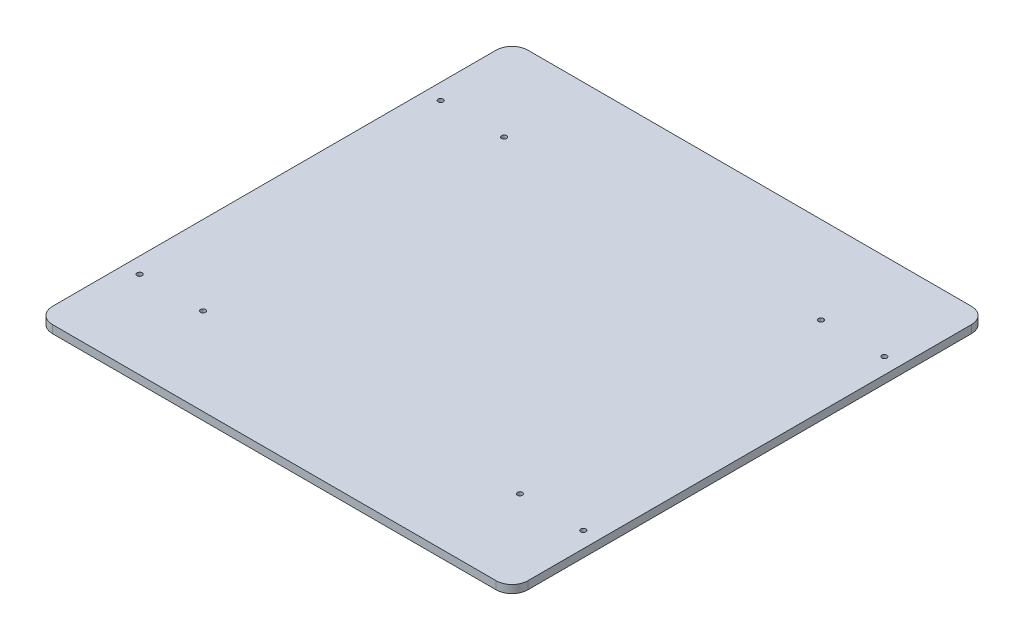
ISO-10303-21;
HEADER;
FILE_DESCRIPTION(('STEP AP214'),'2;1');
FILE_NAME('part.step','',(''),(''),'','','');
FILE_SCHEMA(('AUTOMOTIVE_DESIGN { 1 0 10303 214 1 1 1 1 }'));
ENDSEC;
DATA;
#1=APPLICATION_CONTEXT('core data for automotive mechanical design processes');
#2=APPLICATION_PROTOCOL_DEFINITION('international standard','automotive_design',2000,#1);
#3=PRODUCT_CONTEXT('',#1,'mechanical');
#4=PRODUCT('Part','Part','',(#3));
#5=PRODUCT_RELATED_PRODUCT_CATEGORY('part','',(#4));
#6=PRODUCT_DEFINITION_FORMATION('','',#4);
#7=PRODUCT_DEFINITION_CONTEXT('part definition',#1,'design');
#8=PRODUCT_DEFINITION('design','',#6,#7);
#9=PRODUCT_DEFINITION_SHAPE('','',#8);
#10=(LENGTH_UNIT() NAMED_UNIT(*) SI_UNIT(.MILLI.,.METRE.));
#11=(NAMED_UNIT(*) PLANE_ANGLE_UNIT() SI_UNIT($,.RADIAN.));
#12=(NAMED_UNIT(*) SI_UNIT($,.STERADIAN.) SOLID_ANGLE_UNIT());
#13=UNCERTAINTY_MEASURE_WITH_UNIT(LENGTH_MEASURE(1.E-05),#10,'distance_accuracy_value','');
#14=(GEOMETRIC_REPRESENTATION_CONTEXT(3) GLOBAL_UNCERTAINTY_ASSIGNED_CONTEXT((#13)) GLOBAL_UNIT_ASSIGNED_CONTEXT((#10,
#11,#12)) REPRESENTATION_CONTEXT('',''));
#15=CARTESIAN_POINT('',(0.,0.,0.));
#16=DIRECTION('',(0.,0.,1.));
#17=DIRECTION('',(1.,0.,0.));
#18=AXIS2_PLACEMENT_3D('',#15,#16,#17);
#19=CARTESIAN_POINT('',(140.,5.,-95.));
#20=DIRECTION('',(0.,-1.,0.));
#21=DIRECTION('',(0.,0.,-1.));
#22=AXIS2_PLACEMENT_3D('',#19,#20,#21);
#23=CYLINDRICAL_SURFACE('',#22,1.59999999999999);
#24=CARTESIAN_POINT('',(140.,5.,-95.));
#25=DIRECTION('',(0.,-1.,0.));
#26=DIRECTION('',(0.,0.,-1.));
#27=AXIS2_PLACEMENT_3D('',#24,#25,#26);
#28=CIRCLE('',#27,1.59999999999999);
#29=CARTESIAN_POINT('',(140.,5.,-96.6));
#30=VERTEX_POINT('',#29);
#31=EDGE_CURVE('E52',#30,#30,#28,.T.);
#32=ORIENTED_EDGE('',*,*,#31,.F.);
#33=EDGE_LOOP('',(#32));
#34=FACE_BOUND('',#33,.T.);
#35=CARTESIAN_POINT('',(140.,0.,-95.));
#36=DIRECTION('',(0.,-1.,0.));
#37=DIRECTION('',(0.,0.,-1.));
#38=AXIS2_PLACEMENT_3D('',#35,#36,#37);
#39=CIRCLE('',#38,1.59999999999999);
#40=CARTESIAN_POINT('',(140.,0.,-96.6));
#41=VERTEX_POINT('',#40);
#42=EDGE_CURVE('E11',#41,#41,#39,.T.);
#43=ORIENTED_EDGE('',*,*,#42,.T.);
#44=EDGE_LOOP('',(#43));
#45=FACE_BOUND('',#44,.T.);
#46=ADVANCED_FACE('F44',(#34,#45),#23,.F.);
#47=CARTESIAN_POINT('',(-100.,5.,-95.));
#48=DIRECTION('',(0.,-1.,0.));
#49=DIRECTION('',(0.,0.,-1.));
#50=AXIS2_PLACEMENT_3D('',#47,#48,#49);
#51=CYLINDRICAL_SURFACE('',#50,1.59999999999999);
#52=CARTESIAN_POINT('',(-100.,5.,-95.));
#53=DIRECTION('',(0.,-1.,0.));
#54=DIRECTION('',(0.,0.,-1.));
#55=AXIS2_PLACEMENT_3D('',#52,#53,#54);
#56=CIRCLE('',#55,1.59999999999999);
#57=CARTESIAN_POINT('',(-100.,5.,-96.6));
#58=VERTEX_POINT('',#57);
#59=EDGE_CURVE('E206',#58,#58,#56,.T.);
#60=ORIENTED_EDGE('',*,*,#59,.F.);
#61=EDGE_LOOP('',(#60));
#62=FACE_BOUND('',#61,.T.);
#63=CARTESIAN_POINT('',(-100.,0.,-95.));
#64=DIRECTION('',(0.,-1.,0.));
#65=DIRECTION('',(0.,0.,-1.));
#66=AXIS2_PLACEMENT_3D('',#63,#64,#65);
#67=CIRCLE('',#66,1.59999999999999);
#68=CARTESIAN_POINT('',(-100.,0.,-96.6));
#69=VERTEX_POINT('',#68);
#70=EDGE_CURVE('E210',#69,#69,#67,.T.);
#71=ORIENTED_EDGE('',*,*,#70,.T.);
#72=EDGE_LOOP('',(#71));
#73=FACE_BOUND('',#72,.T.);
#74=ADVANCED_FACE('F221',(#62,#73),#51,.F.);
#75=CARTESIAN_POINT('',(100.,5.,-95.));
#76=DIRECTION('',(0.,-1.,0.));
#77=DIRECTION('',(0.,0.,-1.));
#78=AXIS2_PLACEMENT_3D('',#75,#76,#77);
#79=CYLINDRICAL_SURFACE('',#78,1.59999999999999);
#80=CARTESIAN_POINT('',(100.,5.,-95.));
#81=DIRECTION('',(0.,-1.,0.));
#82=DIRECTION('',(0.,0.,-1.));
#83=AXIS2_PLACEMENT_3D('',#80,#81,#82);
#84=CIRCLE('',#83,1.59999999999999);
#85=CARTESIAN_POINT('',(100.,5.,-96.6));
#86=VERTEX_POINT('',#85);
#87=EDGE_CURVE('E198',#86,#86,#84,.T.);
#88=ORIENTED_EDGE('',*,*,#87,.F.);
#89=EDGE_LOOP('',(#88));
#90=FACE_BOUND('',#89,.T.);
#91=CARTESIAN_POINT('',(100.,0.,-95.));
#92=DIRECTION('',(0.,-1.,0.));
#93=DIRECTION('',(0.,0.,-1.));
#94=AXIS2_PLACEMENT_3D('',#91,#92,#93);
#95=CIRCLE('',#94,1.59999999999999);
#96=CARTESIAN_POINT('',(100.,0.,-96.6));
#97=VERTEX_POINT('',#96);
#98=EDGE_CURVE('E202',#97,#97,#95,.T.);
#99=ORIENTED_EDGE('',*,*,#98,.T.);
#100=EDGE_LOOP('',(#99));
#101=FACE_BOUND('',#100,.T.);
#102=ADVANCED_FACE('F268',(#90,#101),#79,.F.);
#103=CARTESIAN_POINT('',(-140.,5.,-95.));
#104=DIRECTION('',(0.,-1.,0.));
#105=DIRECTION('',(0.,0.,-1.));
#106=AXIS2_PLACEMENT_3D('',#103,#104,#105);
#107=CYLINDRICAL_SURFACE('',#106,1.59999999999999);
#108=CARTESIAN_POINT('',(-140.,5.,-95.));
#109=DIRECTION('',(0.,-1.,0.));
#110=DIRECTION('',(0.,0.,-1.));
#111=AXIS2_PLACEMENT_3D('',#108,#109,#110);
#112=CIRCLE('',#111,1.59999999999999);
#113=CARTESIAN_POINT('',(-140.,5.,-96.6));
#114=VERTEX_POINT('',#113);
#115=EDGE_CURVE('E190',#114,#114,#112,.T.);
#116=ORIENTED_EDGE('',*,*,#115,.F.);
#117=EDGE_LOOP('',(#116));
#118=FACE_BOUND('',#117,.T.);
#119=CARTESIAN_POINT('',(-140.,0.,-95.));
#120=DIRECTION('',(0.,-1.,0.));
#121=DIRECTION('',(0.,0.,-1.));
#122=AXIS2_PLACEMENT_3D('',#119,#120,#121);
#123=CIRCLE('',#122,1.59999999999999);
#124=CARTESIAN_POINT('',(-140.,0.,-96.6));
#125=VERTEX_POINT('',#124);
#126=EDGE_CURVE('E194',#125,#125,#123,.T.);
#127=ORIENTED_EDGE('',*,*,#126,.T.);
#128=EDGE_LOOP('',(#127));
#129=FACE_BOUND('',#128,.T.);
#130=ADVANCED_FACE('F251',(#118,#129),#107,.F.);
#131=CARTESIAN_POINT('',(150.,5.,150.));
#132=DIRECTION('',(-1.,0.,0.));
#133=DIRECTION('',(0.,0.,1.));
#134=AXIS2_PLACEMENT_3D('',#131,#132,#133);
#135=PLANE('',#134);
#136=DIRECTION('',(0.,0.,-1.));
#137=VECTOR('',#136,1.);
#138=CARTESIAN_POINT('',(150.,0.,150.));
#139=LINE('',#138,#137);
#140=CARTESIAN_POINT('',(150.,0.,140.));
#141=VERTEX_POINT('',#140);
#142=CARTESIAN_POINT('',(150.,0.,-140.));
#143=VERTEX_POINT('',#142);
#144=EDGE_CURVE('E147',#141,#143,#139,.T.);
#145=ORIENTED_EDGE('',*,*,#144,.T.);
#146=DIRECTION('',(0.,-1.,0.));
#147=VECTOR('',#146,1.);
#148=CARTESIAN_POINT('',(150.,5.,-140.));
#149=LINE('',#148,#147);
#150=CARTESIAN_POINT('',(150.,5.,-140.));
#151=VERTEX_POINT('',#150);
#152=EDGE_CURVE('E181',#143,#151,#149,.F.);
#153=ORIENTED_EDGE('',*,*,#152,.T.);
#154=DIRECTION('',(0.,0.,-1.));
#155=VECTOR('',#154,1.);
#156=CARTESIAN_POINT('',(150.,5.,150.));
#157=LINE('',#156,#155);
#158=CARTESIAN_POINT('',(150.,5.,140.));
#159=VERTEX_POINT('',#158);
#160=EDGE_CURVE('E145',#159,#151,#157,.T.);
#161=ORIENTED_EDGE('',*,*,#160,.F.);
#162=DIRECTION('',(0.,-1.,0.));
#163=VECTOR('',#162,1.);
#164=CARTESIAN_POINT('',(150.,5.,140.));
#165=LINE('',#164,#163);
#166=EDGE_CURVE('E177',#159,#141,#165,.T.);
#167=ORIENTED_EDGE('',*,*,#166,.T.);
#168=EDGE_LOOP('',(#145,#153,#161,#167));
#169=FACE_BOUND('',#168,.T.);
#170=ADVANCED_FACE('F248',(#169),#135,.F.);
#171=CARTESIAN_POINT('',(-150.,5.,-150.));
#172=DIRECTION('',(0.,0.,1.));
#173=DIRECTION('',(1.,0.,0.));
#174=AXIS2_PLACEMENT_3D('',#171,#172,#173);
#175=PLANE('',#174);
#176=DIRECTION('',(-1.,0.,0.));
#177=VECTOR('',#176,1.);
#178=CARTESIAN_POINT('',(-150.,0.,-150.));
#179=LINE('',#178,#177);
#180=CARTESIAN_POINT('',(140.,0.,-150.));
#181=VERTEX_POINT('',#180);
#182=CARTESIAN_POINT('',(-140.,0.,-150.));
#183=VERTEX_POINT('',#182);
#184=EDGE_CURVE('E141',#181,#183,#179,.T.);
#185=ORIENTED_EDGE('',*,*,#184,.T.);
#186=DIRECTION('',(0.,-1.,0.));
#187=VECTOR('',#186,1.);
#188=CARTESIAN_POINT('',(-140.,5.,-150.));
#189=LINE('',#188,#187);
#190=CARTESIAN_POINT('',(-140.,5.,-150.));
#191=VERTEX_POINT('',#190);
#192=EDGE_CURVE('E116',#183,#191,#189,.F.);
#193=ORIENTED_EDGE('',*,*,#192,.T.);
#194=DIRECTION('',(-1.,0.,0.));
#195=VECTOR('',#194,1.);
#196=CARTESIAN_POINT('',(-150.,5.,-150.));
#197=LINE('',#196,#195);
#198=CARTESIAN_POINT('',(140.,5.,-150.));
#199=VERTEX_POINT('',#198);
#200=EDGE_CURVE('E473',#199,#191,#197,.T.);
#201=ORIENTED_EDGE('',*,*,#200,.F.);
#202=DIRECTION('',(0.,-1.,0.));
#203=VECTOR('',#202,1.);
#204=CARTESIAN_POINT('',(140.,5.,-150.));
#205=LINE('',#204,#203);
#206=EDGE_CURVE('E122',#199,#181,#205,.T.);
#207=ORIENTED_EDGE('',*,*,#206,.T.);
#208=EDGE_LOOP('',(#185,#193,#201,#207));
#209=FACE_BOUND('',#208,.T.);
#210=ADVANCED_FACE('F245',(#209),#175,.F.);
#211=CARTESIAN_POINT('',(-150.,5.,150.));
#212=DIRECTION('',(1.,0.,0.));
#213=DIRECTION('',(0.,0.,-1.));
#214=AXIS2_PLACEMENT_3D('',#211,#212,#213);
#215=PLANE('',#214);
#216=DIRECTION('',(0.,0.,1.));
#217=VECTOR('',#216,1.);
#218=CARTESIAN_POINT('',(-150.,5.,150.));
#219=LINE('',#218,#217);
#220=CARTESIAN_POINT('',(-150.,5.,-140.));
#221=VERTEX_POINT('',#220);
#222=CARTESIAN_POINT('',(-150.,5.,140.));
#223=VERTEX_POINT('',#222);
#224=EDGE_CURVE('E131',#221,#223,#219,.T.);
#225=ORIENTED_EDGE('',*,*,#224,.F.);
#226=DIRECTION('',(0.,-1.,0.));
#227=VECTOR('',#226,1.);
#228=CARTESIAN_POINT('',(-150.,5.,-140.));
#229=LINE('',#228,#227);
#230=CARTESIAN_POINT('',(-150.,0.,-140.));
#231=VERTEX_POINT('',#230);
#232=EDGE_CURVE('E115',#221,#231,#229,.T.);
#233=ORIENTED_EDGE('',*,*,#232,.T.);
#234=DIRECTION('',(0.,0.,1.));
#235=VECTOR('',#234,1.);
#236=CARTESIAN_POINT('',(-150.,0.,150.));
#237=LINE('',#236,#235);
#238=CARTESIAN_POINT('',(-150.,0.,140.));
#239=VERTEX_POINT('',#238);
#240=EDGE_CURVE('E129',#231,#239,#237,.T.);
#241=ORIENTED_EDGE('',*,*,#240,.T.);
#242=DIRECTION('',(0.,-1.,0.));
#243=VECTOR('',#242,1.);
#244=CARTESIAN_POINT('',(-150.,5.,140.));
#245=LINE('',#244,#243);
#246=EDGE_CURVE('E134',#239,#223,#245,.F.);
#247=ORIENTED_EDGE('',*,*,#246,.T.);
#248=EDGE_LOOP('',(#225,#233,#241,#247));
#249=FACE_BOUND('',#248,.T.);
#250=ADVANCED_FACE('F128',(#249),#215,.F.);
#251=CARTESIAN_POINT('',(-150.,5.,150.));
#252=DIRECTION('',(0.,0.,-1.));
#253=DIRECTION('',(-1.,0.,0.));
#254=AXIS2_PLACEMENT_3D('',#251,#252,#253);
#255=PLANE('',#254);
#256=DIRECTION('',(1.,0.,0.));
#257=VECTOR('',#256,1.);
#258=CARTESIAN_POINT('',(-150.,0.,150.));
#259=LINE('',#258,#257);
#260=CARTESIAN_POINT('',(-140.,0.,150.));
#261=VERTEX_POINT('',#260);
#262=CARTESIAN_POINT('',(140.,0.,150.));
#263=VERTEX_POINT('',#262);
#264=EDGE_CURVE('E140',#261,#263,#259,.T.);
#265=ORIENTED_EDGE('',*,*,#264,.T.);
#266=DIRECTION('',(0.,-1.,0.));
#267=VECTOR('',#266,1.);
#268=CARTESIAN_POINT('',(140.,5.,150.));
#269=LINE('',#268,#267);
#270=CARTESIAN_POINT('',(140.,5.,150.));
#271=VERTEX_POINT('',#270);
#272=EDGE_CURVE('E59',#263,#271,#269,.F.);
#273=ORIENTED_EDGE('',*,*,#272,.T.);
#274=DIRECTION('',(1.,0.,0.));
#275=VECTOR('',#274,1.);
#276=CARTESIAN_POINT('',(-150.,5.,150.));
#277=LINE('',#276,#275);
#278=CARTESIAN_POINT('',(-140.,5.,150.));
#279=VERTEX_POINT('',#278);
#280=EDGE_CURVE('E152',#279,#271,#277,.T.);
#281=ORIENTED_EDGE('',*,*,#280,.F.);
#282=DIRECTION('',(0.,-1.,0.));
#283=VECTOR('',#282,1.);
#284=CARTESIAN_POINT('',(-140.,5.,150.));
#285=LINE('',#284,#283);
#286=EDGE_CURVE('E184',#279,#261,#285,.T.);
#287=ORIENTED_EDGE('',*,*,#286,.T.);
#288=EDGE_LOOP('',(#265,#273,#281,#287));
#289=FACE_BOUND('',#288,.T.);
#290=ADVANCED_FACE('F234',(#289),#255,.F.);
#291=CARTESIAN_POINT('',(0.,5.,0.));
#292=DIRECTION('',(0.,-1.,0.));
#293=DIRECTION('',(0.,0.,-1.));
#294=AXIS2_PLACEMENT_3D('',#291,#292,#293);
#295=PLANE('',#294);
#296=CARTESIAN_POINT('',(140.,5.,95.));
#297=DIRECTION('',(0.,-1.,0.));
#298=DIRECTION('',(0.,0.,-1.));
#299=AXIS2_PLACEMENT_3D('',#296,#297,#298);
#300=CIRCLE('',#299,1.59999999999999);
#301=CARTESIAN_POINT('',(140.,5.,93.4));
#302=VERTEX_POINT('',#301);
#303=EDGE_CURVE('E438',#302,#302,#300,.T.);
#304=ORIENTED_EDGE('',*,*,#303,.T.);
#305=EDGE_LOOP('',(#304));
#306=FACE_BOUND('',#305,.T.);
#307=CARTESIAN_POINT('',(100.,5.,95.));
#308=DIRECTION('',(0.,-1.,0.));
#309=DIRECTION('',(0.,0.,-1.));
#310=AXIS2_PLACEMENT_3D('',#307,#308,#309);
#311=CIRCLE('',#310,1.59999999999999);
#312=CARTESIAN_POINT('',(100.,5.,93.4));
#313=VERTEX_POINT('',#312);
#314=EDGE_CURVE('E442',#313,#313,#311,.T.);
#315=ORIENTED_EDGE('',*,*,#314,.T.);
#316=EDGE_LOOP('',(#315));
#317=FACE_BOUND('',#316,.T.);
#318=CARTESIAN_POINT('',(-140.,5.,95.));
#319=DIRECTION('',(0.,-1.,0.));
#320=DIRECTION('',(0.,0.,-1.));
#321=AXIS2_PLACEMENT_3D('',#318,#319,#320);
#322=CIRCLE('',#321,1.59999999999999);
#323=CARTESIAN_POINT('',(-140.,5.,93.4));
#324=VERTEX_POINT('',#323);
#325=EDGE_CURVE('E455',#324,#324,#322,.T.);
#326=ORIENTED_EDGE('',*,*,#325,.T.);
#327=EDGE_LOOP('',(#326));
#328=FACE_BOUND('',#327,.T.);
#329=CARTESIAN_POINT('',(-100.,5.,95.));
#330=DIRECTION('',(0.,-1.,0.));
#331=DIRECTION('',(0.,0.,-1.));
#332=AXIS2_PLACEMENT_3D('',#329,#330,#331);
#333=CIRCLE('',#332,1.59999999999999);
#334=CARTESIAN_POINT('',(-100.,5.,93.4));
#335=VERTEX_POINT('',#334);
#336=EDGE_CURVE('E454',#335,#335,#333,.T.);
#337=ORIENTED_EDGE('',*,*,#336,.T.);
#338=EDGE_LOOP('',(#337));
#339=FACE_BOUND('',#338,.T.);
#340=ORIENTED_EDGE('',*,*,#200,.T.);
#341=CARTESIAN_POINT('',(-140.,5.,-140.));
#342=DIRECTION('',(0.,-1.,0.));
#343=DIRECTION('',(0.,0.,-1.));
#344=AXIS2_PLACEMENT_3D('',#341,#342,#343);
#345=CIRCLE('',#344,10.);
#346=EDGE_CURVE('E174',#191,#221,#345,.F.);
#347=ORIENTED_EDGE('',*,*,#346,.T.);
#348=ORIENTED_EDGE('',*,*,#224,.T.);
#349=CARTESIAN_POINT('',(-140.,5.,140.));
#350=DIRECTION('',(0.,-1.,0.));
#351=DIRECTION('',(0.,0.,-1.));
#352=AXIS2_PLACEMENT_3D('',#349,#350,#351);
#353=CIRCLE('',#352,10.);
#354=EDGE_CURVE('E66',#223,#279,#353,.F.);
#355=ORIENTED_EDGE('',*,*,#354,.T.);
#356=ORIENTED_EDGE('',*,*,#280,.T.);
#357=CARTESIAN_POINT('',(140.,5.,140.));
#358=DIRECTION('',(0.,-1.,0.));
#359=DIRECTION('',(0.,0.,-1.));
#360=AXIS2_PLACEMENT_3D('',#357,#358,#359);
#361=CIRCLE('',#360,10.);
#362=EDGE_CURVE('E168',#271,#159,#361,.F.);
#363=ORIENTED_EDGE('',*,*,#362,.T.);
#364=ORIENTED_EDGE('',*,*,#160,.T.);
#365=CARTESIAN_POINT('',(140.,5.,-140.));
#366=DIRECTION('',(0.,-1.,0.));
#367=DIRECTION('',(0.,0.,-1.));
#368=AXIS2_PLACEMENT_3D('',#365,#366,#367);
#369=CIRCLE('',#368,10.);
#370=EDGE_CURVE('E171',#151,#199,#369,.F.);
#371=ORIENTED_EDGE('',*,*,#370,.T.);
#372=EDGE_LOOP('',(#340,#347,#348,#355,#356,#363,#364,#371));
#373=FACE_BOUND('',#372,.T.);
#374=ORIENTED_EDGE('',*,*,#115,.T.);
#375=EDGE_LOOP('',(#374));
#376=FACE_BOUND('',#375,.T.);
#377=ORIENTED_EDGE('',*,*,#87,.T.);
#378=EDGE_LOOP('',(#377));
#379=FACE_BOUND('',#378,.T.);
#380=ORIENTED_EDGE('',*,*,#59,.T.);
#381=EDGE_LOOP('',(#380));
#382=FACE_BOUND('',#381,.T.);
#383=ORIENTED_EDGE('',*,*,#31,.T.);
#384=EDGE_LOOP('',(#383));
#385=FACE_BOUND('',#384,.T.);
#386=ADVANCED_FACE('F217',(#306,#317,#328,#339,#373,#376,#379,#382,#385),#295,.F.);
#387=CARTESIAN_POINT('',(0.,0.,0.));
#388=DIRECTION('',(0.,-1.,0.));
#389=DIRECTION('',(0.,0.,-1.));
#390=AXIS2_PLACEMENT_3D('',#387,#388,#389);
#391=PLANE('',#390);
#392=CARTESIAN_POINT('',(140.,0.,95.));
#393=DIRECTION('',(0.,-1.,0.));
#394=DIRECTION('',(0.,0.,-1.));
#395=AXIS2_PLACEMENT_3D('',#392,#393,#394);
#396=CIRCLE('',#395,1.59999999999999);
#397=CARTESIAN_POINT('',(140.,0.,93.4));
#398=VERTEX_POINT('',#397);
#399=EDGE_CURVE('E440',#398,#398,#396,.T.);
#400=ORIENTED_EDGE('',*,*,#399,.F.);
#401=EDGE_LOOP('',(#400));
#402=FACE_BOUND('',#401,.T.);
#403=CARTESIAN_POINT('',(100.,0.,95.));
#404=DIRECTION('',(0.,-1.,0.));
#405=DIRECTION('',(0.,0.,-1.));
#406=AXIS2_PLACEMENT_3D('',#403,#404,#405);
#407=CIRCLE('',#406,1.59999999999999);
#408=CARTESIAN_POINT('',(100.,0.,93.4));
#409=VERTEX_POINT('',#408);
#410=EDGE_CURVE('E447',#409,#409,#407,.T.);
#411=ORIENTED_EDGE('',*,*,#410,.F.);
#412=EDGE_LOOP('',(#411));
#413=FACE_BOUND('',#412,.T.);
#414=CARTESIAN_POINT('',(-140.,0.,95.));
#415=DIRECTION('',(0.,-1.,0.));
#416=DIRECTION('',(0.,0.,-1.));
#417=AXIS2_PLACEMENT_3D('',#414,#415,#416);
#418=CIRCLE('',#417,1.59999999999999);
#419=CARTESIAN_POINT('',(-140.,0.,93.4));
#420=VERTEX_POINT('',#419);
#421=EDGE_CURVE('E459',#420,#420,#418,.T.);
#422=ORIENTED_EDGE('',*,*,#421,.F.);
#423=EDGE_LOOP('',(#422));
#424=FACE_BOUND('',#423,.T.);
#425=CARTESIAN_POINT('',(-100.,0.,95.));
#426=DIRECTION('',(0.,-1.,0.));
#427=DIRECTION('',(0.,0.,-1.));
#428=AXIS2_PLACEMENT_3D('',#425,#426,#427);
#429=CIRCLE('',#428,1.59999999999999);
#430=CARTESIAN_POINT('',(-100.,0.,93.4));
#431=VERTEX_POINT('',#430);
#432=EDGE_CURVE('E463',#431,#431,#429,.T.);
#433=ORIENTED_EDGE('',*,*,#432,.F.);
#434=EDGE_LOOP('',(#433));
#435=FACE_BOUND('',#434,.T.);
#436=ORIENTED_EDGE('',*,*,#240,.F.);
#437=CARTESIAN_POINT('',(-140.,0.,-140.));
#438=DIRECTION('',(0.,-1.,0.));
#439=DIRECTION('',(0.,0.,-1.));
#440=AXIS2_PLACEMENT_3D('',#437,#438,#439);
#441=CIRCLE('',#440,10.);
#442=EDGE_CURVE('E111',#231,#183,#441,.T.);
#443=ORIENTED_EDGE('',*,*,#442,.T.);
#444=ORIENTED_EDGE('',*,*,#184,.F.);
#445=CARTESIAN_POINT('',(140.,0.,-140.));
#446=DIRECTION('',(0.,-1.,0.));
#447=DIRECTION('',(0.,0.,-1.));
#448=AXIS2_PLACEMENT_3D('',#445,#446,#447);
#449=CIRCLE('',#448,10.);
#450=EDGE_CURVE('E123',#181,#143,#449,.T.);
#451=ORIENTED_EDGE('',*,*,#450,.T.);
#452=ORIENTED_EDGE('',*,*,#144,.F.);
#453=CARTESIAN_POINT('',(140.,0.,140.));
#454=DIRECTION('',(0.,-1.,0.));
#455=DIRECTION('',(0.,0.,-1.));
#456=AXIS2_PLACEMENT_3D('',#453,#454,#455);
#457=CIRCLE('',#456,10.);
#458=EDGE_CURVE('E156',#141,#263,#457,.T.);
#459=ORIENTED_EDGE('',*,*,#458,.T.);
#460=ORIENTED_EDGE('',*,*,#264,.F.);
#461=CARTESIAN_POINT('',(-140.,0.,140.));
#462=DIRECTION('',(0.,-1.,0.));
#463=DIRECTION('',(0.,0.,-1.));
#464=AXIS2_PLACEMENT_3D('',#461,#462,#463);
#465=CIRCLE('',#464,10.);
#466=EDGE_CURVE('E133',#261,#239,#465,.T.);
#467=ORIENTED_EDGE('',*,*,#466,.T.);
#468=EDGE_LOOP('',(#436,#443,#444,#451,#452,#459,#460,#467));
#469=FACE_BOUND('',#468,.T.);
#470=ORIENTED_EDGE('',*,*,#126,.F.);
#471=EDGE_LOOP('',(#470));
#472=FACE_BOUND('',#471,.T.);
#473=ORIENTED_EDGE('',*,*,#98,.F.);
#474=EDGE_LOOP('',(#473));
#475=FACE_BOUND('',#474,.T.);
#476=ORIENTED_EDGE('',*,*,#70,.F.);
#477=EDGE_LOOP('',(#476));
#478=FACE_BOUND('',#477,.T.);
#479=ORIENTED_EDGE('',*,*,#42,.F.);
#480=EDGE_LOOP('',(#479));
#481=FACE_BOUND('',#480,.T.);
#482=ADVANCED_FACE('F136',(#402,#413,#424,#435,#469,#472,#475,#478,#481),#391,.T.);
#483=CARTESIAN_POINT('',(-140.,5.,-140.));
#484=DIRECTION('',(0.,-1.,0.));
#485=DIRECTION('',(0.,0.,-1.));
#486=AXIS2_PLACEMENT_3D('',#483,#484,#485);
#487=CYLINDRICAL_SURFACE('',#486,10.);
#488=ORIENTED_EDGE('',*,*,#346,.F.);
#489=ORIENTED_EDGE('',*,*,#192,.F.);
#490=ORIENTED_EDGE('',*,*,#442,.F.);
#491=ORIENTED_EDGE('',*,*,#232,.F.);
#492=EDGE_LOOP('',(#488,#489,#490,#491));
#493=FACE_BOUND('',#492,.T.);
#494=ADVANCED_FACE('F114',(#493),#487,.T.);
#495=CARTESIAN_POINT('',(140.,5.,-140.));
#496=DIRECTION('',(0.,-1.,0.));
#497=DIRECTION('',(0.,0.,-1.));
#498=AXIS2_PLACEMENT_3D('',#495,#496,#497);
#499=CYLINDRICAL_SURFACE('',#498,10.);
#500=ORIENTED_EDGE('',*,*,#370,.F.);
#501=ORIENTED_EDGE('',*,*,#152,.F.);
#502=ORIENTED_EDGE('',*,*,#450,.F.);
#503=ORIENTED_EDGE('',*,*,#206,.F.);
#504=EDGE_LOOP('',(#500,#501,#502,#503));
#505=FACE_BOUND('',#504,.T.);
#506=ADVANCED_FACE('F232',(#505),#499,.T.);
#507=CARTESIAN_POINT('',(140.,5.,140.));
#508=DIRECTION('',(0.,-1.,0.));
#509=DIRECTION('',(0.,0.,-1.));
#510=AXIS2_PLACEMENT_3D('',#507,#508,#509);
#511=CYLINDRICAL_SURFACE('',#510,10.);
#512=ORIENTED_EDGE('',*,*,#362,.F.);
#513=ORIENTED_EDGE('',*,*,#272,.F.);
#514=ORIENTED_EDGE('',*,*,#458,.F.);
#515=ORIENTED_EDGE('',*,*,#166,.F.);
#516=EDGE_LOOP('',(#512,#513,#514,#515));
#517=FACE_BOUND('',#516,.T.);
#518=ADVANCED_FACE('F256',(#517),#511,.T.);
#519=CARTESIAN_POINT('',(-140.,5.,140.));
#520=DIRECTION('',(0.,-1.,0.));
#521=DIRECTION('',(0.,0.,-1.));
#522=AXIS2_PLACEMENT_3D('',#519,#520,#521);
#523=CYLINDRICAL_SURFACE('',#522,10.);
#524=ORIENTED_EDGE('',*,*,#354,.F.);
#525=ORIENTED_EDGE('',*,*,#246,.F.);
#526=ORIENTED_EDGE('',*,*,#466,.F.);
#527=ORIENTED_EDGE('',*,*,#286,.F.);
#528=EDGE_LOOP('',(#524,#525,#526,#527));
#529=FACE_BOUND('',#528,.T.);
#530=ADVANCED_FACE('F260',(#529),#523,.T.);
#531=CARTESIAN_POINT('',(-100.,5.,95.));
#532=DIRECTION('',(0.,-1.,0.));
#533=DIRECTION('',(0.,0.,-1.));
#534=AXIS2_PLACEMENT_3D('',#531,#532,#533);
#535=CYLINDRICAL_SURFACE('',#534,1.59999999999999);
#536=ORIENTED_EDGE('',*,*,#336,.F.);
#537=EDGE_LOOP('',(#536));
#538=FACE_BOUND('',#537,.T.);
#539=ORIENTED_EDGE('',*,*,#432,.T.);
#540=EDGE_LOOP('',(#539));
#541=FACE_BOUND('',#540,.T.);
#542=ADVANCED_FACE('F264',(#538,#541),#535,.F.);
#543=CARTESIAN_POINT('',(-140.,5.,95.));
#544=DIRECTION('',(0.,-1.,0.));
#545=DIRECTION('',(0.,0.,-1.));
#546=AXIS2_PLACEMENT_3D('',#543,#544,#545);
#547=CYLINDRICAL_SURFACE('',#546,1.59999999999999);
#548=ORIENTED_EDGE('',*,*,#325,.F.);
#549=EDGE_LOOP('',(#548));
#550=FACE_BOUND('',#549,.T.);
#551=ORIENTED_EDGE('',*,*,#421,.T.);
#552=EDGE_LOOP('',(#551));
#553=FACE_BOUND('',#552,.T.);
#554=ADVANCED_FACE('F297',(#550,#553),#547,.F.);
#555=CARTESIAN_POINT('',(100.,5.,95.));
#556=DIRECTION('',(0.,-1.,0.));
#557=DIRECTION('',(0.,0.,-1.));
#558=AXIS2_PLACEMENT_3D('',#555,#556,#557);
#559=CYLINDRICAL_SURFACE('',#558,1.59999999999999);
#560=ORIENTED_EDGE('',*,*,#314,.F.);
#561=EDGE_LOOP('',(#560));
#562=FACE_BOUND('',#561,.T.);
#563=ORIENTED_EDGE('',*,*,#410,.T.);
#564=EDGE_LOOP('',(#563));
#565=FACE_BOUND('',#564,.T.);
#566=ADVANCED_FACE('F305',(#562,#565),#559,.F.);
#567=CARTESIAN_POINT('',(140.,5.,95.));
#568=DIRECTION('',(0.,-1.,0.));
#569=DIRECTION('',(0.,0.,-1.));
#570=AXIS2_PLACEMENT_3D('',#567,#568,#569);
#571=CYLINDRICAL_SURFACE('',#570,1.59999999999999);
#572=ORIENTED_EDGE('',*,*,#303,.F.);
#573=EDGE_LOOP('',(#572));
#574=FACE_BOUND('',#573,.T.);
#575=ORIENTED_EDGE('',*,*,#399,.T.);
#576=EDGE_LOOP('',(#575));
#577=FACE_BOUND('',#576,.T.);
#578=ADVANCED_FACE('F312',(#574,#577),#571,.F.);
#579=CLOSED_SHELL('',(#46,#74,#102,#130,#170,#210,#250,#290,#386,#482,#494,#506,#518,#530,#542,
#554,#566,#578));
#580=MANIFOLD_SOLID_BREP('B2',#579);
#581=ADVANCED_BREP_SHAPE_REPRESENTATION('',(#18,#580),#14);
#582=SHAPE_DEFINITION_REPRESENTATION(#9,#581);
ENDSEC;
END-ISO-10303-21;
